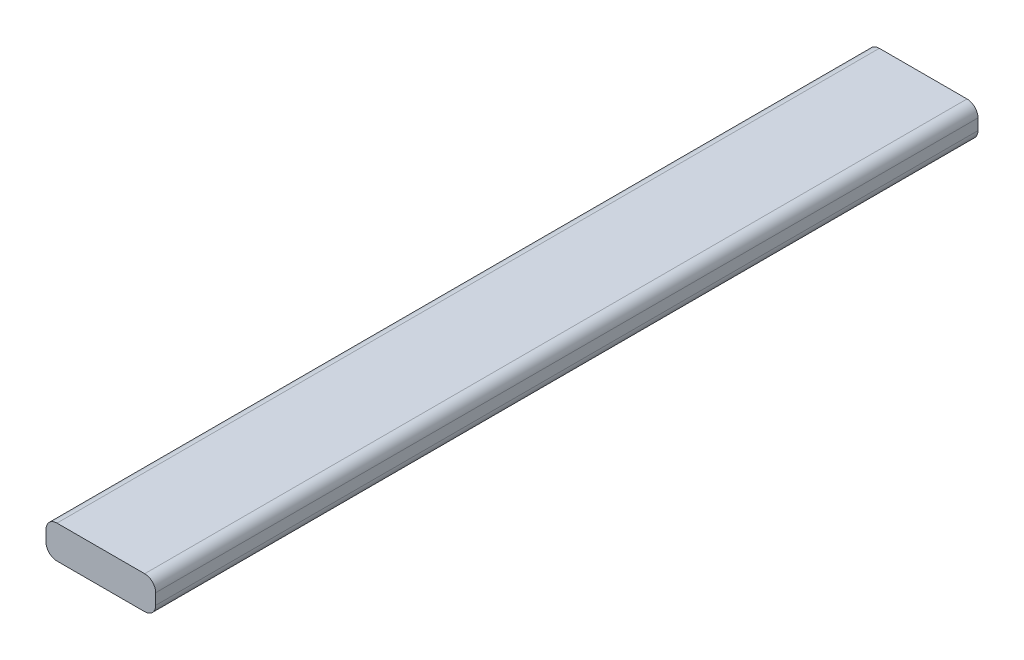
ISO-10303-21;
HEADER;
FILE_DESCRIPTION(('STEP AP214'),'2;1');
FILE_NAME('part.step','',(''),(''),'','','');
FILE_SCHEMA(('AUTOMOTIVE_DESIGN { 1 0 10303 214 1 1 1 1 }'));
ENDSEC;
DATA;
#1=APPLICATION_CONTEXT('core data for automotive mechanical design processes');
#2=APPLICATION_PROTOCOL_DEFINITION('international standard','automotive_design',2000,#1);
#3=PRODUCT_CONTEXT('',#1,'mechanical');
#4=PRODUCT('Part','Part','',(#3));
#5=PRODUCT_RELATED_PRODUCT_CATEGORY('part','',(#4));
#6=PRODUCT_DEFINITION_FORMATION('','',#4);
#7=PRODUCT_DEFINITION_CONTEXT('part definition',#1,'design');
#8=PRODUCT_DEFINITION('design','',#6,#7);
#9=PRODUCT_DEFINITION_SHAPE('','',#8);
#10=(LENGTH_UNIT() NAMED_UNIT(*) SI_UNIT(.MILLI.,.METRE.));
#11=(NAMED_UNIT(*) PLANE_ANGLE_UNIT() SI_UNIT($,.RADIAN.));
#12=(NAMED_UNIT(*) SI_UNIT($,.STERADIAN.) SOLID_ANGLE_UNIT());
#13=UNCERTAINTY_MEASURE_WITH_UNIT(LENGTH_MEASURE(1.E-05),#10,'distance_accuracy_value','');
#14=(GEOMETRIC_REPRESENTATION_CONTEXT(3) GLOBAL_UNCERTAINTY_ASSIGNED_CONTEXT((#13)) GLOBAL_UNIT_ASSIGNED_CONTEXT((#10,
#11,#12)) REPRESENTATION_CONTEXT('',''));
#15=CARTESIAN_POINT('',(0.,0.,0.));
#16=DIRECTION('',(0.,0.,1.));
#17=DIRECTION('',(1.,0.,0.));
#18=AXIS2_PLACEMENT_3D('',#15,#16,#17);
#19=CARTESIAN_POINT('',(4.,0.5,75.));
#20=DIRECTION('',(0.,0.,-1.));
#21=DIRECTION('',(-1.,0.,0.));
#22=AXIS2_PLACEMENT_3D('',#19,#20,#21);
#23=CYLINDRICAL_SURFACE('',#22,1.);
#24=CARTESIAN_POINT('',(4.,0.5,0.));
#25=DIRECTION('',(0.,0.,1.));
#26=DIRECTION('',(-1.,0.,0.));
#27=AXIS2_PLACEMENT_3D('',#24,#25,#26);
#28=CIRCLE('',#27,1.);
#29=CARTESIAN_POINT('',(5.,0.5,0.));
#30=VERTEX_POINT('',#29);
#31=CARTESIAN_POINT('',(4.,1.5,0.));
#32=VERTEX_POINT('',#31);
#33=EDGE_CURVE('E129',#30,#32,#28,.T.);
#34=ORIENTED_EDGE('',*,*,#33,.T.);
#35=DIRECTION('',(0.,0.,-1.));
#36=VECTOR('',#35,1.);
#37=CARTESIAN_POINT('',(4.,1.5,75.));
#38=LINE('',#37,#36);
#39=CARTESIAN_POINT('',(4.,1.5,75.));
#40=VERTEX_POINT('',#39);
#41=EDGE_CURVE('E11',#40,#32,#38,.T.);
#42=ORIENTED_EDGE('',*,*,#41,.F.);
#43=CARTESIAN_POINT('',(4.,0.5,75.));
#44=DIRECTION('',(0.,0.,1.));
#45=DIRECTION('',(-1.,0.,0.));
#46=AXIS2_PLACEMENT_3D('',#43,#44,#45);
#47=CIRCLE('',#46,1.);
#48=CARTESIAN_POINT('',(5.,0.5,75.));
#49=VERTEX_POINT('',#48);
#50=EDGE_CURVE('E143',#49,#40,#47,.T.);
#51=ORIENTED_EDGE('',*,*,#50,.F.);
#52=DIRECTION('',(0.,0.,-1.));
#53=VECTOR('',#52,1.);
#54=CARTESIAN_POINT('',(5.,0.5,75.));
#55=LINE('',#54,#53);
#56=EDGE_CURVE('E125',#49,#30,#55,.T.);
#57=ORIENTED_EDGE('',*,*,#56,.T.);
#58=EDGE_LOOP('',(#34,#42,#51,#57));
#59=FACE_BOUND('',#58,.T.);
#60=ADVANCED_FACE('F33',(#59),#23,.T.);
#61=CARTESIAN_POINT('',(-4.,1.5,75.));
#62=DIRECTION('',(0.,-1.,0.));
#63=DIRECTION('',(0.,0.,-1.));
#64=AXIS2_PLACEMENT_3D('',#61,#62,#63);
#65=PLANE('',#64);
#66=DIRECTION('',(-1.,0.,0.));
#67=VECTOR('',#66,1.);
#68=CARTESIAN_POINT('',(-4.,1.5,0.));
#69=LINE('',#68,#67);
#70=CARTESIAN_POINT('',(-4.,1.5,0.));
#71=VERTEX_POINT('',#70);
#72=EDGE_CURVE('E132',#32,#71,#69,.T.);
#73=ORIENTED_EDGE('',*,*,#72,.T.);
#74=DIRECTION('',(0.,0.,-1.));
#75=VECTOR('',#74,1.);
#76=CARTESIAN_POINT('',(-4.,1.5,75.));
#77=LINE('',#76,#75);
#78=CARTESIAN_POINT('',(-4.,1.5,75.));
#79=VERTEX_POINT('',#78);
#80=EDGE_CURVE('E41',#79,#71,#77,.T.);
#81=ORIENTED_EDGE('',*,*,#80,.F.);
#82=DIRECTION('',(-1.,0.,0.));
#83=VECTOR('',#82,1.);
#84=CARTESIAN_POINT('',(-4.,1.5,75.));
#85=LINE('',#84,#83);
#86=EDGE_CURVE('E92',#40,#79,#85,.T.);
#87=ORIENTED_EDGE('',*,*,#86,.F.);
#88=ORIENTED_EDGE('',*,*,#41,.T.);
#89=EDGE_LOOP('',(#73,#81,#87,#88));
#90=FACE_BOUND('',#89,.T.);
#91=ADVANCED_FACE('F178',(#90),#65,.F.);
#92=CARTESIAN_POINT('',(-4.,0.5,75.));
#93=DIRECTION('',(0.,0.,-1.));
#94=DIRECTION('',(-1.,0.,0.));
#95=AXIS2_PLACEMENT_3D('',#92,#93,#94);
#96=CYLINDRICAL_SURFACE('',#95,1.);
#97=CARTESIAN_POINT('',(-4.,0.5,0.));
#98=DIRECTION('',(0.,0.,1.));
#99=DIRECTION('',(1.,0.,0.));
#100=AXIS2_PLACEMENT_3D('',#97,#98,#99);
#101=CIRCLE('',#100,1.);
#102=CARTESIAN_POINT('',(-5.,0.5,0.));
#103=VERTEX_POINT('',#102);
#104=EDGE_CURVE('E134',#71,#103,#101,.T.);
#105=ORIENTED_EDGE('',*,*,#104,.T.);
#106=DIRECTION('',(0.,0.,-1.));
#107=VECTOR('',#106,1.);
#108=CARTESIAN_POINT('',(-5.,0.5,75.));
#109=LINE('',#108,#107);
#110=CARTESIAN_POINT('',(-5.,0.5,75.));
#111=VERTEX_POINT('',#110);
#112=EDGE_CURVE('E150',#111,#103,#109,.T.);
#113=ORIENTED_EDGE('',*,*,#112,.F.);
#114=CARTESIAN_POINT('',(-4.,0.5,75.));
#115=DIRECTION('',(0.,0.,1.));
#116=DIRECTION('',(1.,0.,0.));
#117=AXIS2_PLACEMENT_3D('',#114,#115,#116);
#118=CIRCLE('',#117,1.);
#119=EDGE_CURVE('E158',#79,#111,#118,.T.);
#120=ORIENTED_EDGE('',*,*,#119,.F.);
#121=ORIENTED_EDGE('',*,*,#80,.T.);
#122=EDGE_LOOP('',(#105,#113,#120,#121));
#123=FACE_BOUND('',#122,.T.);
#124=ADVANCED_FACE('F156',(#123),#96,.T.);
#125=CARTESIAN_POINT('',(-5.,0.5,75.));
#126=DIRECTION('',(1.,0.,0.));
#127=DIRECTION('',(0.,0.,-1.));
#128=AXIS2_PLACEMENT_3D('',#125,#126,#127);
#129=PLANE('',#128);
#130=DIRECTION('',(0.,-1.,0.));
#131=VECTOR('',#130,1.);
#132=CARTESIAN_POINT('',(-5.,0.5,0.));
#133=LINE('',#132,#131);
#134=CARTESIAN_POINT('',(-5.,-0.5,0.));
#135=VERTEX_POINT('',#134);
#136=EDGE_CURVE('E136',#103,#135,#133,.T.);
#137=ORIENTED_EDGE('',*,*,#136,.T.);
#138=DIRECTION('',(0.,0.,-1.));
#139=VECTOR('',#138,1.);
#140=CARTESIAN_POINT('',(-5.,-0.5,75.));
#141=LINE('',#140,#139);
#142=CARTESIAN_POINT('',(-5.,-0.5,75.));
#143=VERTEX_POINT('',#142);
#144=EDGE_CURVE('E147',#143,#135,#141,.T.);
#145=ORIENTED_EDGE('',*,*,#144,.F.);
#146=DIRECTION('',(0.,-1.,0.));
#147=VECTOR('',#146,1.);
#148=CARTESIAN_POINT('',(-5.,0.5,75.));
#149=LINE('',#148,#147);
#150=EDGE_CURVE('E170',#111,#143,#149,.T.);
#151=ORIENTED_EDGE('',*,*,#150,.F.);
#152=ORIENTED_EDGE('',*,*,#112,.T.);
#153=EDGE_LOOP('',(#137,#145,#151,#152));
#154=FACE_BOUND('',#153,.T.);
#155=ADVANCED_FACE('F166',(#154),#129,.F.);
#156=CARTESIAN_POINT('',(-4.,-0.5,75.));
#157=DIRECTION('',(0.,0.,-1.));
#158=DIRECTION('',(-1.,0.,0.));
#159=AXIS2_PLACEMENT_3D('',#156,#157,#158);
#160=CYLINDRICAL_SURFACE('',#159,1.);
#161=CARTESIAN_POINT('',(-4.,-0.5,0.));
#162=DIRECTION('',(0.,0.,1.));
#163=DIRECTION('',(1.,0.,0.));
#164=AXIS2_PLACEMENT_3D('',#161,#162,#163);
#165=CIRCLE('',#164,1.);
#166=CARTESIAN_POINT('',(-4.,-1.5,0.));
#167=VERTEX_POINT('',#166);
#168=EDGE_CURVE('E138',#135,#167,#165,.T.);
#169=ORIENTED_EDGE('',*,*,#168,.T.);
#170=DIRECTION('',(0.,0.,-1.));
#171=VECTOR('',#170,1.);
#172=CARTESIAN_POINT('',(-4.,-1.5,75.));
#173=LINE('',#172,#171);
#174=CARTESIAN_POINT('',(-4.,-1.5,75.));
#175=VERTEX_POINT('',#174);
#176=EDGE_CURVE('E120',#175,#167,#173,.T.);
#177=ORIENTED_EDGE('',*,*,#176,.F.);
#178=CARTESIAN_POINT('',(-4.,-0.5,75.));
#179=DIRECTION('',(0.,0.,1.));
#180=DIRECTION('',(1.,0.,0.));
#181=AXIS2_PLACEMENT_3D('',#178,#179,#180);
#182=CIRCLE('',#181,1.);
#183=EDGE_CURVE('E111',#143,#175,#182,.T.);
#184=ORIENTED_EDGE('',*,*,#183,.F.);
#185=ORIENTED_EDGE('',*,*,#144,.T.);
#186=EDGE_LOOP('',(#169,#177,#184,#185));
#187=FACE_BOUND('',#186,.T.);
#188=ADVANCED_FACE('F169',(#187),#160,.T.);
#189=CARTESIAN_POINT('',(-4.,-1.5,75.));
#190=DIRECTION('',(0.,1.,0.));
#191=DIRECTION('',(0.,0.,1.));
#192=AXIS2_PLACEMENT_3D('',#189,#190,#191);
#193=PLANE('',#192);
#194=DIRECTION('',(1.,0.,0.));
#195=VECTOR('',#194,1.);
#196=CARTESIAN_POINT('',(-4.,-1.5,0.));
#197=LINE('',#196,#195);
#198=CARTESIAN_POINT('',(4.,-1.5,0.));
#199=VERTEX_POINT('',#198);
#200=EDGE_CURVE('E119',#167,#199,#197,.T.);
#201=ORIENTED_EDGE('',*,*,#200,.T.);
#202=DIRECTION('',(0.,0.,-1.));
#203=VECTOR('',#202,1.);
#204=CARTESIAN_POINT('',(4.,-1.5,75.));
#205=LINE('',#204,#203);
#206=CARTESIAN_POINT('',(4.,-1.5,75.));
#207=VERTEX_POINT('',#206);
#208=EDGE_CURVE('E116',#207,#199,#205,.T.);
#209=ORIENTED_EDGE('',*,*,#208,.F.);
#210=DIRECTION('',(1.,0.,0.));
#211=VECTOR('',#210,1.);
#212=CARTESIAN_POINT('',(-4.,-1.5,75.));
#213=LINE('',#212,#211);
#214=EDGE_CURVE('E105',#175,#207,#213,.T.);
#215=ORIENTED_EDGE('',*,*,#214,.F.);
#216=ORIENTED_EDGE('',*,*,#176,.T.);
#217=EDGE_LOOP('',(#201,#209,#215,#216));
#218=FACE_BOUND('',#217,.T.);
#219=ADVANCED_FACE('F117',(#218),#193,.F.);
#220=CARTESIAN_POINT('',(4.,-0.5,75.));
#221=DIRECTION('',(0.,0.,-1.));
#222=DIRECTION('',(-1.,0.,0.));
#223=AXIS2_PLACEMENT_3D('',#220,#221,#222);
#224=CYLINDRICAL_SURFACE('',#223,1.);
#225=CARTESIAN_POINT('',(4.,-0.5,0.));
#226=DIRECTION('',(0.,0.,1.));
#227=DIRECTION('',(1.,0.,0.));
#228=AXIS2_PLACEMENT_3D('',#225,#226,#227);
#229=CIRCLE('',#228,1.);
#230=CARTESIAN_POINT('',(5.,-0.5,0.));
#231=VERTEX_POINT('',#230);
#232=EDGE_CURVE('E78',#199,#231,#229,.T.);
#233=ORIENTED_EDGE('',*,*,#232,.T.);
#234=DIRECTION('',(0.,0.,-1.));
#235=VECTOR('',#234,1.);
#236=CARTESIAN_POINT('',(5.,-0.5,75.));
#237=LINE('',#236,#235);
#238=CARTESIAN_POINT('',(5.,-0.5,75.));
#239=VERTEX_POINT('',#238);
#240=EDGE_CURVE('E121',#239,#231,#237,.T.);
#241=ORIENTED_EDGE('',*,*,#240,.F.);
#242=CARTESIAN_POINT('',(4.,-0.5,75.));
#243=DIRECTION('',(0.,0.,1.));
#244=DIRECTION('',(1.,0.,0.));
#245=AXIS2_PLACEMENT_3D('',#242,#243,#244);
#246=CIRCLE('',#245,1.);
#247=EDGE_CURVE('E109',#207,#239,#246,.T.);
#248=ORIENTED_EDGE('',*,*,#247,.F.);
#249=ORIENTED_EDGE('',*,*,#208,.T.);
#250=EDGE_LOOP('',(#233,#241,#248,#249));
#251=FACE_BOUND('',#250,.T.);
#252=ADVANCED_FACE('F123',(#251),#224,.T.);
#253=CARTESIAN_POINT('',(5.,0.5,75.));
#254=DIRECTION('',(-1.,0.,0.));
#255=DIRECTION('',(0.,0.,1.));
#256=AXIS2_PLACEMENT_3D('',#253,#254,#255);
#257=PLANE('',#256);
#258=DIRECTION('',(0.,1.,0.));
#259=VECTOR('',#258,1.);
#260=CARTESIAN_POINT('',(5.,0.5,0.));
#261=LINE('',#260,#259);
#262=EDGE_CURVE('E84',#231,#30,#261,.T.);
#263=ORIENTED_EDGE('',*,*,#262,.T.);
#264=ORIENTED_EDGE('',*,*,#56,.F.);
#265=DIRECTION('',(0.,1.,0.));
#266=VECTOR('',#265,1.);
#267=CARTESIAN_POINT('',(5.,0.5,75.));
#268=LINE('',#267,#266);
#269=EDGE_CURVE('E49',#239,#49,#268,.T.);
#270=ORIENTED_EDGE('',*,*,#269,.F.);
#271=ORIENTED_EDGE('',*,*,#240,.T.);
#272=EDGE_LOOP('',(#263,#264,#270,#271));
#273=FACE_BOUND('',#272,.T.);
#274=ADVANCED_FACE('F194',(#273),#257,.F.);
#275=CARTESIAN_POINT('',(4.,0.5,75.));
#276=DIRECTION('',(0.,0.,-1.));
#277=DIRECTION('',(-1.,0.,0.));
#278=AXIS2_PLACEMENT_3D('',#275,#276,#277);
#279=PLANE('',#278);
#280=ORIENTED_EDGE('',*,*,#50,.T.);
#281=ORIENTED_EDGE('',*,*,#86,.T.);
#282=ORIENTED_EDGE('',*,*,#119,.T.);
#283=ORIENTED_EDGE('',*,*,#150,.T.);
#284=ORIENTED_EDGE('',*,*,#183,.T.);
#285=ORIENTED_EDGE('',*,*,#214,.T.);
#286=ORIENTED_EDGE('',*,*,#247,.T.);
#287=ORIENTED_EDGE('',*,*,#269,.T.);
#288=EDGE_LOOP('',(#280,#281,#282,#283,#284,#285,#286,#287));
#289=FACE_BOUND('',#288,.T.);
#290=ADVANCED_FACE('F107',(#289),#279,.F.);
#291=CARTESIAN_POINT('',(4.,0.5,0.));
#292=DIRECTION('',(0.,0.,-1.));
#293=DIRECTION('',(-1.,0.,0.));
#294=AXIS2_PLACEMENT_3D('',#291,#292,#293);
#295=PLANE('',#294);
#296=ORIENTED_EDGE('',*,*,#33,.F.);
#297=ORIENTED_EDGE('',*,*,#262,.F.);
#298=ORIENTED_EDGE('',*,*,#232,.F.);
#299=ORIENTED_EDGE('',*,*,#200,.F.);
#300=ORIENTED_EDGE('',*,*,#168,.F.);
#301=ORIENTED_EDGE('',*,*,#136,.F.);
#302=ORIENTED_EDGE('',*,*,#104,.F.);
#303=ORIENTED_EDGE('',*,*,#72,.F.);
#304=EDGE_LOOP('',(#296,#297,#298,#299,#300,#301,#302,#303));
#305=FACE_BOUND('',#304,.T.);
#306=ADVANCED_FACE('F162',(#305),#295,.T.);
#307=CLOSED_SHELL('',(#60,#91,#124,#155,#188,#219,#252,#274,#290,#306));
#308=MANIFOLD_SOLID_BREP('B2',#307);
#309=ADVANCED_BREP_SHAPE_REPRESENTATION('',(#18,#308),#14);
#310=SHAPE_DEFINITION_REPRESENTATION(#9,#309);
ENDSEC;
END-ISO-10303-21;
